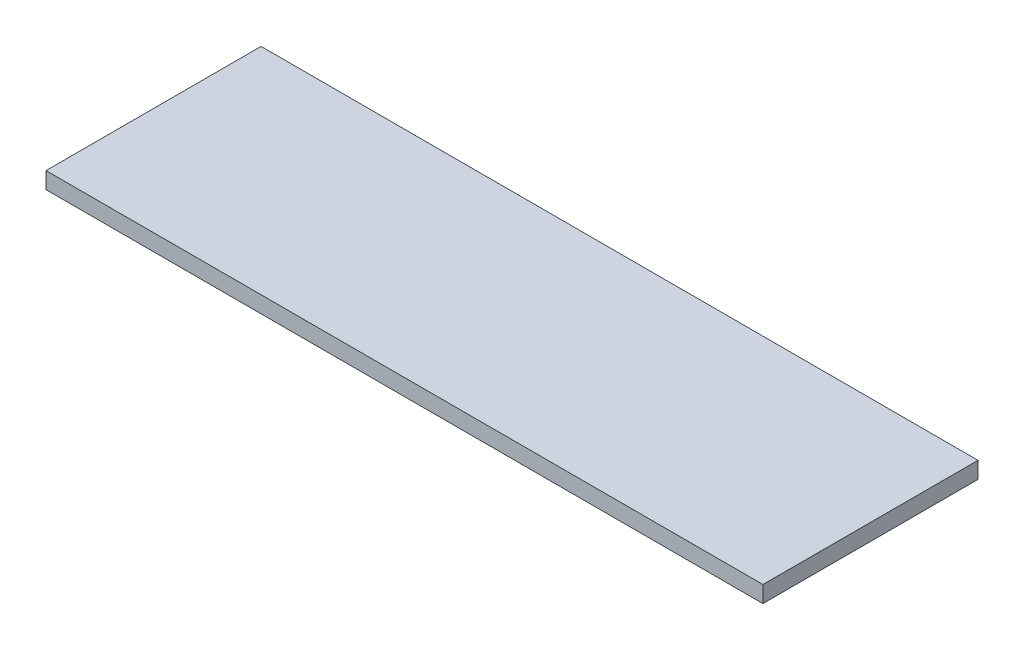
ISO-10303-21;
HEADER;
FILE_DESCRIPTION(('STEP AP214'),'2;1');
FILE_NAME('part.step','',(''),(''),'','','');
FILE_SCHEMA(('AUTOMOTIVE_DESIGN { 1 0 10303 214 1 1 1 1 }'));
ENDSEC;
DATA;
#1=APPLICATION_CONTEXT('core data for automotive mechanical design processes');
#2=APPLICATION_PROTOCOL_DEFINITION('international standard','automotive_design',2000,#1);
#3=PRODUCT_CONTEXT('',#1,'mechanical');
#4=PRODUCT('Part','Part','',(#3));
#5=PRODUCT_RELATED_PRODUCT_CATEGORY('part','',(#4));
#6=PRODUCT_DEFINITION_FORMATION('','',#4);
#7=PRODUCT_DEFINITION_CONTEXT('part definition',#1,'design');
#8=PRODUCT_DEFINITION('design','',#6,#7);
#9=PRODUCT_DEFINITION_SHAPE('','',#8);
#10=(LENGTH_UNIT() NAMED_UNIT(*) SI_UNIT(.MILLI.,.METRE.));
#11=(NAMED_UNIT(*) PLANE_ANGLE_UNIT() SI_UNIT($,.RADIAN.));
#12=(NAMED_UNIT(*) SI_UNIT($,.STERADIAN.) SOLID_ANGLE_UNIT());
#13=UNCERTAINTY_MEASURE_WITH_UNIT(LENGTH_MEASURE(1.E-05),#10,'distance_accuracy_value','');
#14=(GEOMETRIC_REPRESENTATION_CONTEXT(3) GLOBAL_UNCERTAINTY_ASSIGNED_CONTEXT((#13)) GLOBAL_UNIT_ASSIGNED_CONTEXT((#10,
#11,#12)) REPRESENTATION_CONTEXT('',''));
#15=CARTESIAN_POINT('',(0.,0.,0.));
#16=DIRECTION('',(0.,0.,1.));
#17=DIRECTION('',(1.,0.,0.));
#18=AXIS2_PLACEMENT_3D('',#15,#16,#17);
#19=CARTESIAN_POINT('',(0.,3.,2.88916494206861));
#20=DIRECTION('',(1.,0.,0.));
#21=DIRECTION('',(0.,0.,-1.));
#22=AXIS2_PLACEMENT_3D('',#19,#20,#21);
#23=PLANE('',#22);
#24=DIRECTION('',(0.,0.,1.));
#25=VECTOR('',#24,1.);
#26=CARTESIAN_POINT('',(0.,0.,2.88916494206861));
#27=LINE('',#26,#25);
#28=CARTESIAN_POINT('',(0.,0.,-36.1108350579314));
#29=VERTEX_POINT('',#28);
#30=CARTESIAN_POINT('',(0.,0.,2.88916494206861));
#31=VERTEX_POINT('',#30);
#32=EDGE_CURVE('E96',#29,#31,#27,.T.);
#33=ORIENTED_EDGE('',*,*,#32,.T.);
#34=DIRECTION('',(0.,-1.,0.));
#35=VECTOR('',#34,1.);
#36=CARTESIAN_POINT('',(0.,3.,2.88916494206861));
#37=LINE('',#36,#35);
#38=CARTESIAN_POINT('',(0.,3.,2.88916494206861));
#39=VERTEX_POINT('',#38);
#40=EDGE_CURVE('E11',#39,#31,#37,.T.);
#41=ORIENTED_EDGE('',*,*,#40,.F.);
#42=DIRECTION('',(0.,0.,1.));
#43=VECTOR('',#42,1.);
#44=CARTESIAN_POINT('',(0.,3.,2.88916494206861));
#45=LINE('',#44,#43);
#46=CARTESIAN_POINT('',(0.,3.,-36.1108350579314));
#47=VERTEX_POINT('',#46);
#48=EDGE_CURVE('E84',#47,#39,#45,.T.);
#49=ORIENTED_EDGE('',*,*,#48,.F.);
#50=DIRECTION('',(0.,-1.,0.));
#51=VECTOR('',#50,1.);
#52=CARTESIAN_POINT('',(0.,3.,-36.1108350579314));
#53=LINE('',#52,#51);
#54=EDGE_CURVE('E92',#47,#29,#53,.T.);
#55=ORIENTED_EDGE('',*,*,#54,.T.);
#56=EDGE_LOOP('',(#33,#41,#49,#55));
#57=FACE_BOUND('',#56,.T.);
#58=ADVANCED_FACE('F33',(#57),#23,.F.);
#59=CARTESIAN_POINT('',(0.,3.,2.88916494206861));
#60=DIRECTION('',(0.,0.,-1.));
#61=DIRECTION('',(-1.,0.,0.));
#62=AXIS2_PLACEMENT_3D('',#59,#60,#61);
#63=PLANE('',#62);
#64=DIRECTION('',(1.,0.,0.));
#65=VECTOR('',#64,1.);
#66=CARTESIAN_POINT('',(0.,0.,2.88916494206861));
#67=LINE('',#66,#65);
#68=CARTESIAN_POINT('',(130.,0.,2.88916494206861));
#69=VERTEX_POINT('',#68);
#70=EDGE_CURVE('E88',#31,#69,#67,.T.);
#71=ORIENTED_EDGE('',*,*,#70,.T.);
#72=DIRECTION('',(0.,-1.,0.));
#73=VECTOR('',#72,1.);
#74=CARTESIAN_POINT('',(130.,3.,2.88916494206861));
#75=LINE('',#74,#73);
#76=CARTESIAN_POINT('',(130.,3.,2.88916494206861));
#77=VERTEX_POINT('',#76);
#78=EDGE_CURVE('E41',#77,#69,#75,.T.);
#79=ORIENTED_EDGE('',*,*,#78,.F.);
#80=DIRECTION('',(1.,0.,0.));
#81=VECTOR('',#80,1.);
#82=CARTESIAN_POINT('',(0.,3.,2.88916494206861));
#83=LINE('',#82,#81);
#84=EDGE_CURVE('E79',#39,#77,#83,.T.);
#85=ORIENTED_EDGE('',*,*,#84,.F.);
#86=ORIENTED_EDGE('',*,*,#40,.T.);
#87=EDGE_LOOP('',(#71,#79,#85,#86));
#88=FACE_BOUND('',#87,.T.);
#89=ADVANCED_FACE('F87',(#88),#63,.F.);
#90=CARTESIAN_POINT('',(130.,3.,2.88916494206861));
#91=DIRECTION('',(-1.,0.,0.));
#92=DIRECTION('',(0.,0.,1.));
#93=AXIS2_PLACEMENT_3D('',#90,#91,#92);
#94=PLANE('',#93);
#95=DIRECTION('',(0.,0.,-1.));
#96=VECTOR('',#95,1.);
#97=CARTESIAN_POINT('',(130.,0.,2.88916494206861));
#98=LINE('',#97,#96);
#99=CARTESIAN_POINT('',(130.,0.,-36.1108350579314));
#100=VERTEX_POINT('',#99);
#101=EDGE_CURVE('E66',#69,#100,#98,.T.);
#102=ORIENTED_EDGE('',*,*,#101,.T.);
#103=DIRECTION('',(0.,-1.,0.));
#104=VECTOR('',#103,1.);
#105=CARTESIAN_POINT('',(130.,3.,-36.1108350579314));
#106=LINE('',#105,#104);
#107=CARTESIAN_POINT('',(130.,3.,-36.1108350579314));
#108=VERTEX_POINT('',#107);
#109=EDGE_CURVE('E89',#108,#100,#106,.T.);
#110=ORIENTED_EDGE('',*,*,#109,.F.);
#111=DIRECTION('',(0.,0.,-1.));
#112=VECTOR('',#111,1.);
#113=CARTESIAN_POINT('',(130.,3.,2.88916494206861));
#114=LINE('',#113,#112);
#115=EDGE_CURVE('E82',#77,#108,#114,.T.);
#116=ORIENTED_EDGE('',*,*,#115,.F.);
#117=ORIENTED_EDGE('',*,*,#78,.T.);
#118=EDGE_LOOP('',(#102,#110,#116,#117));
#119=FACE_BOUND('',#118,.T.);
#120=ADVANCED_FACE('F90',(#119),#94,.F.);
#121=CARTESIAN_POINT('',(0.,3.,-36.1108350579314));
#122=DIRECTION('',(0.,0.,1.));
#123=DIRECTION('',(1.,0.,0.));
#124=AXIS2_PLACEMENT_3D('',#121,#122,#123);
#125=PLANE('',#124);
#126=DIRECTION('',(-1.,0.,0.));
#127=VECTOR('',#126,1.);
#128=CARTESIAN_POINT('',(0.,0.,-36.1108350579314));
#129=LINE('',#128,#127);
#130=EDGE_CURVE('E72',#100,#29,#129,.T.);
#131=ORIENTED_EDGE('',*,*,#130,.T.);
#132=ORIENTED_EDGE('',*,*,#54,.F.);
#133=DIRECTION('',(-1.,0.,0.));
#134=VECTOR('',#133,1.);
#135=CARTESIAN_POINT('',(0.,3.,-36.1108350579314));
#136=LINE('',#135,#134);
#137=EDGE_CURVE('E49',#108,#47,#136,.T.);
#138=ORIENTED_EDGE('',*,*,#137,.F.);
#139=ORIENTED_EDGE('',*,*,#109,.T.);
#140=EDGE_LOOP('',(#131,#132,#138,#139));
#141=FACE_BOUND('',#140,.T.);
#142=ADVANCED_FACE('F103',(#141),#125,.F.);
#143=CARTESIAN_POINT('',(0.,3.,0.));
#144=DIRECTION('',(0.,-1.,0.));
#145=DIRECTION('',(0.,0.,-1.));
#146=AXIS2_PLACEMENT_3D('',#143,#144,#145);
#147=PLANE('',#146);
#148=ORIENTED_EDGE('',*,*,#48,.T.);
#149=ORIENTED_EDGE('',*,*,#84,.T.);
#150=ORIENTED_EDGE('',*,*,#115,.T.);
#151=ORIENTED_EDGE('',*,*,#137,.T.);
#152=EDGE_LOOP('',(#148,#149,#150,#151));
#153=FACE_BOUND('',#152,.T.);
#154=ADVANCED_FACE('F80',(#153),#147,.F.);
#155=CARTESIAN_POINT('',(0.,0.,0.));
#156=DIRECTION('',(0.,-1.,0.));
#157=DIRECTION('',(0.,0.,-1.));
#158=AXIS2_PLACEMENT_3D('',#155,#156,#157);
#159=PLANE('',#158);
#160=ORIENTED_EDGE('',*,*,#32,.F.);
#161=ORIENTED_EDGE('',*,*,#130,.F.);
#162=ORIENTED_EDGE('',*,*,#101,.F.);
#163=ORIENTED_EDGE('',*,*,#70,.F.);
#164=EDGE_LOOP('',(#160,#161,#162,#163));
#165=FACE_BOUND('',#164,.T.);
#166=ADVANCED_FACE('F106',(#165),#159,.T.);
#167=CLOSED_SHELL('',(#58,#89,#120,#142,#154,#166));
#168=MANIFOLD_SOLID_BREP('B2',#167);
#169=ADVANCED_BREP_SHAPE_REPRESENTATION('',(#18,#168),#14);
#170=SHAPE_DEFINITION_REPRESENTATION(#9,#169);
ENDSEC;
END-ISO-10303-21;
